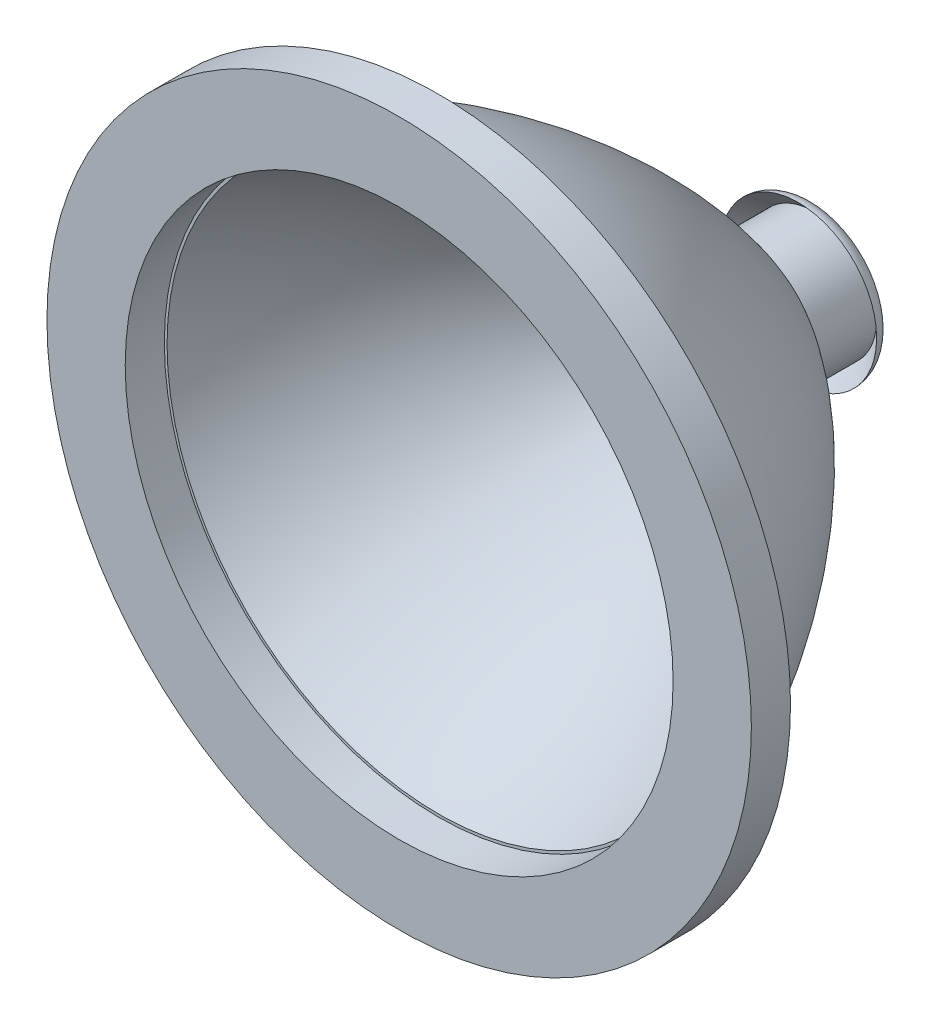
ISO-10303-21;
HEADER;
FILE_DESCRIPTION(('STEP AP214'),'2;1');
FILE_NAME('part.step','',(''),(''),'','','');
FILE_SCHEMA(('AUTOMOTIVE_DESIGN { 1 0 10303 214 1 1 1 1 }'));
ENDSEC;
DATA;
#1=APPLICATION_CONTEXT('core data for automotive mechanical design processes');
#2=APPLICATION_PROTOCOL_DEFINITION('international standard','automotive_design',2000,#1);
#3=PRODUCT_CONTEXT('',#1,'mechanical');
#4=PRODUCT('Part','Part','',(#3));
#5=PRODUCT_RELATED_PRODUCT_CATEGORY('part','',(#4));
#6=PRODUCT_DEFINITION_FORMATION('','',#4);
#7=PRODUCT_DEFINITION_CONTEXT('part definition',#1,'design');
#8=PRODUCT_DEFINITION('design','',#6,#7);
#9=PRODUCT_DEFINITION_SHAPE('','',#8);
#10=(LENGTH_UNIT() NAMED_UNIT(*) SI_UNIT(.MILLI.,.METRE.));
#11=(NAMED_UNIT(*) PLANE_ANGLE_UNIT() SI_UNIT($,.RADIAN.));
#12=(NAMED_UNIT(*) SI_UNIT($,.STERADIAN.) SOLID_ANGLE_UNIT());
#13=UNCERTAINTY_MEASURE_WITH_UNIT(LENGTH_MEASURE(1.E-05),#10,'distance_accuracy_value','');
#14=(GEOMETRIC_REPRESENTATION_CONTEXT(3) GLOBAL_UNCERTAINTY_ASSIGNED_CONTEXT((#13)) GLOBAL_UNIT_ASSIGNED_CONTEXT((#10,
#11,#12)) REPRESENTATION_CONTEXT('',''));
#15=CARTESIAN_POINT('',(0.,0.,0.));
#16=DIRECTION('',(0.,0.,1.));
#17=DIRECTION('',(1.,0.,0.));
#18=AXIS2_PLACEMENT_3D('',#15,#16,#17);
#19=CARTESIAN_POINT('',(0.,0.,-58.42));
#20=DIRECTION('',(0.,0.,1.));
#21=DIRECTION('',(1.,0.,0.));
#22=AXIS2_PLACEMENT_3D('',#19,#20,#21);
#23=TOROIDAL_SURFACE('',#22,10.16,2.54);
#24=CARTESIAN_POINT('',(0.,0.,-58.42));
#25=DIRECTION('',(0.,0.,1.));
#26=DIRECTION('',(1.,0.,0.));
#27=AXIS2_PLACEMENT_3D('',#24,#25,#26);
#28=CIRCLE('',#27,12.7);
#29=CARTESIAN_POINT('',(12.7,0.,-58.42));
#30=VERTEX_POINT('',#29);
#31=EDGE_CURVE('E11',#30,#30,#28,.T.);
#32=ORIENTED_EDGE('',*,*,#31,.F.);
#33=EDGE_LOOP('',(#32));
#34=FACE_BOUND('',#33,.T.);
#35=CARTESIAN_POINT('',(0.,0.,-60.96));
#36=DIRECTION('',(0.,0.,1.));
#37=DIRECTION('',(1.,0.,0.));
#38=AXIS2_PLACEMENT_3D('',#35,#36,#37);
#39=CIRCLE('',#38,10.16);
#40=CARTESIAN_POINT('',(10.16,0.,-60.96));
#41=VERTEX_POINT('',#40);
#42=EDGE_CURVE('E51',#41,#41,#39,.T.);
#43=ORIENTED_EDGE('',*,*,#42,.T.);
#44=EDGE_LOOP('',(#43));
#45=FACE_BOUND('',#44,.T.);
#46=ADVANCED_FACE('F45',(#34,#45),#23,.T.);
#47=CARTESIAN_POINT('',(0.,0.,-58.42));
#48=DIRECTION('',(0.,0.,1.));
#49=DIRECTION('',(1.,0.,0.));
#50=AXIS2_PLACEMENT_3D('',#47,#48,#49);
#51=CONICAL_SURFACE('',#50,12.7,0.785398163397448);
#52=ORIENTED_EDGE('',*,*,#42,.F.);
#53=EDGE_LOOP('',(#52));
#54=FACE_BOUND('',#53,.T.);
#55=ORIENTED_EDGE('',*,*,#31,.T.);
#56=EDGE_LOOP('',(#55));
#57=FACE_BOUND('',#56,.T.);
#58=ADVANCED_FACE('F58',(#54,#57),#51,.F.);
#59=CLOSED_SHELL('',(#46,#58));
#60=MANIFOLD_SOLID_BREP('B2',#59);
#61=CARTESIAN_POINT('',(0.,50.8,0.));
#62=DIRECTION('',(0.,0.,-1.));
#63=DIRECTION('',(-1.,0.,0.));
#64=AXIS2_PLACEMENT_3D('',#61,#62,#63);
#65=PLANE('',#64);
#66=CARTESIAN_POINT('',(0.,0.,0.));
#67=DIRECTION('',(0.,0.,-1.));
#68=DIRECTION('',(-1.,0.,0.));
#69=AXIS2_PLACEMENT_3D('',#66,#67,#68);
#70=CIRCLE('',#69,44.0129431509694);
#71=CARTESIAN_POINT('',(-44.0129431509694,0.,0.));
#72=VERTEX_POINT('',#71);
#73=EDGE_CURVE('E88',#72,#72,#70,.F.);
#74=ORIENTED_EDGE('',*,*,#73,.F.);
#75=EDGE_LOOP('',(#74));
#76=FACE_BOUND('',#75,.T.);
#77=CARTESIAN_POINT('',(0.,0.,0.));
#78=DIRECTION('',(0.,0.,1.));
#79=DIRECTION('',(1.,0.,0.));
#80=AXIS2_PLACEMENT_3D('',#77,#78,#79);
#81=CIRCLE('',#80,44.45);
#82=CARTESIAN_POINT('',(44.45,0.,0.));
#83=VERTEX_POINT('',#82);
#84=EDGE_CURVE('E119',#83,#83,#81,.T.);
#85=ORIENTED_EDGE('',*,*,#84,.T.);
#86=EDGE_LOOP('',(#85));
#87=FACE_BOUND('',#86,.T.);
#88=ADVANCED_FACE('F77',(#76,#87),#65,.F.);
#89=CARTESIAN_POINT('',(0.,0.,34.7283102836008));
#90=DIRECTION('',(0.,0.,1.));
#91=DIRECTION('',(1.,0.,0.));
#92=AXIS2_PLACEMENT_3D('',#89,#90,#91);
#93=DEGENERATE_TOROIDAL_SURFACE('',#92,44.680387854501,101.6,.F.);
#94=CARTESIAN_POINT('',(0.,0.,0.));
#95=DIRECTION('',(0.,0.,1.));
#96=DIRECTION('',(1.,0.,0.));
#97=AXIS2_PLACEMENT_3D('',#94,#95,#96);
#98=CIRCLE('',#97,50.8);
#99=CARTESIAN_POINT('',(50.8,0.,0.));
#100=VERTEX_POINT('',#99);
#101=EDGE_CURVE('E44',#100,#100,#98,.T.);
#102=ORIENTED_EDGE('',*,*,#101,.F.);
#103=EDGE_LOOP('',(#102));
#104=FACE_BOUND('',#103,.T.);
#105=CARTESIAN_POINT('',(0.,0.,-50.8));
#106=DIRECTION('',(0.,0.,-1.));
#107=DIRECTION('',(-1.,0.,0.));
#108=AXIS2_PLACEMENT_3D('',#105,#106,#107);
#109=CIRCLE('',#108,10.16);
#110=CARTESIAN_POINT('',(-10.16,0.,-50.8));
#111=VERTEX_POINT('',#110);
#112=EDGE_CURVE('E95',#111,#111,#109,.T.);
#113=ORIENTED_EDGE('',*,*,#112,.F.);
#114=EDGE_LOOP('',(#113));
#115=FACE_BOUND('',#114,.T.);
#116=ADVANCED_FACE('F79',(#104,#115),#93,.F.);
#117=CARTESIAN_POINT('',(0.,0.,34.7283102836008));
#118=DIRECTION('',(0.,0.,1.));
#119=DIRECTION('',(1.,0.,0.));
#120=AXIS2_PLACEMENT_3D('',#117,#118,#119);
#121=DEGENERATE_TOROIDAL_SURFACE('',#120,44.680387854501,95.25,.F.);
#122=ORIENTED_EDGE('',*,*,#73,.T.);
#123=EDGE_LOOP('',(#122));
#124=FACE_BOUND('',#123,.T.);
#125=CARTESIAN_POINT('',(0.,0.,-44.45));
#126=DIRECTION('',(0.,0.,1.));
#127=DIRECTION('',(1.,0.,0.));
#128=AXIS2_PLACEMENT_3D('',#125,#126,#127);
#129=CIRCLE('',#128,8.26635596071236);
#130=CARTESIAN_POINT('',(8.26635596071236,0.,-44.45));
#131=VERTEX_POINT('',#130);
#132=EDGE_CURVE('E84',#131,#131,#129,.T.);
#133=ORIENTED_EDGE('',*,*,#132,.F.);
#134=EDGE_LOOP('',(#133));
#135=FACE_BOUND('',#134,.T.);
#136=ADVANCED_FACE('F150',(#124,#135),#121,.T.);
#137=CARTESIAN_POINT('',(0.,0.,-44.45));
#138=DIRECTION('',(0.,0.,1.));
#139=DIRECTION('',(1.,0.,0.));
#140=AXIS2_PLACEMENT_3D('',#137,#138,#139);
#141=PLANE('',#140);
#142=CARTESIAN_POINT('',(0.,0.,-44.45));
#143=DIRECTION('',(0.,0.,1.));
#144=DIRECTION('',(1.,0.,0.));
#145=AXIS2_PLACEMENT_3D('',#142,#143,#144);
#146=CIRCLE('',#145,7.62);
#147=CARTESIAN_POINT('',(7.62,0.,-44.45));
#148=VERTEX_POINT('',#147);
#149=EDGE_CURVE('E109',#148,#148,#146,.T.);
#150=ORIENTED_EDGE('',*,*,#149,.F.);
#151=EDGE_LOOP('',(#150));
#152=FACE_BOUND('',#151,.T.);
#153=ORIENTED_EDGE('',*,*,#132,.T.);
#154=EDGE_LOOP('',(#153));
#155=FACE_BOUND('',#154,.T.);
#156=ADVANCED_FACE('F155',(#152,#155),#141,.T.);
#157=CARTESIAN_POINT('',(0.,0.,-60.96));
#158=DIRECTION('',(0.,0.,1.));
#159=DIRECTION('',(1.,0.,0.));
#160=AXIS2_PLACEMENT_3D('',#157,#158,#159);
#161=CYLINDRICAL_SURFACE('',#160,10.16);
#162=CARTESIAN_POINT('',(0.,0.,-60.96));
#163=DIRECTION('',(0.,0.,-1.));
#164=DIRECTION('',(-1.,0.,0.));
#165=AXIS2_PLACEMENT_3D('',#162,#163,#164);
#166=CIRCLE('',#165,10.16);
#167=CARTESIAN_POINT('',(-10.16,0.,-60.96));
#168=VERTEX_POINT('',#167);
#169=EDGE_CURVE('E93',#168,#168,#166,.T.);
#170=ORIENTED_EDGE('',*,*,#169,.F.);
#171=EDGE_LOOP('',(#170));
#172=FACE_BOUND('',#171,.T.);
#173=ORIENTED_EDGE('',*,*,#112,.T.);
#174=EDGE_LOOP('',(#173));
#175=FACE_BOUND('',#174,.T.);
#176=ADVANCED_FACE('F158',(#172,#175),#161,.T.);
#177=CARTESIAN_POINT('',(0.,0.,-60.96));
#178=DIRECTION('',(0.,0.,-1.));
#179=DIRECTION('',(-1.,0.,0.));
#180=AXIS2_PLACEMENT_3D('',#177,#178,#179);
#181=PLANE('',#180);
#182=CARTESIAN_POINT('',(0.,0.,-60.96));
#183=DIRECTION('',(0.,0.,1.));
#184=DIRECTION('',(1.,0.,0.));
#185=AXIS2_PLACEMENT_3D('',#182,#183,#184);
#186=CIRCLE('',#185,6.94563);
#187=CARTESIAN_POINT('',(6.94563,0.,-60.96));
#188=VERTEX_POINT('',#187);
#189=EDGE_CURVE('E98',#188,#188,#186,.T.);
#190=ORIENTED_EDGE('',*,*,#189,.T.);
#191=EDGE_LOOP('',(#190));
#192=FACE_BOUND('',#191,.T.);
#193=ORIENTED_EDGE('',*,*,#169,.T.);
#194=EDGE_LOOP('',(#193));
#195=FACE_BOUND('',#194,.T.);
#196=ADVANCED_FACE('F165',(#192,#195),#181,.T.);
#197=CARTESIAN_POINT('',(0.,0.,-44.45));
#198=DIRECTION('',(0.,0.,1.));
#199=DIRECTION('',(1.,0.,0.));
#200=AXIS2_PLACEMENT_3D('',#197,#198,#199);
#201=CYLINDRICAL_SURFACE('',#200,6.94563);
#202=ORIENTED_EDGE('',*,*,#189,.F.);
#203=EDGE_LOOP('',(#202));
#204=FACE_BOUND('',#203,.T.);
#205=CARTESIAN_POINT('',(0.,0.,-49.53));
#206=DIRECTION('',(0.,0.,1.));
#207=DIRECTION('',(1.,0.,0.));
#208=AXIS2_PLACEMENT_3D('',#205,#206,#207);
#209=CIRCLE('',#208,6.94563);
#210=CARTESIAN_POINT('',(6.94563,0.,-49.53));
#211=VERTEX_POINT('',#210);
#212=EDGE_CURVE('E103',#211,#211,#209,.T.);
#213=ORIENTED_EDGE('',*,*,#212,.T.);
#214=EDGE_LOOP('',(#213));
#215=FACE_BOUND('',#214,.T.);
#216=ADVANCED_FACE('F169',(#204,#215),#201,.F.);
#217=CARTESIAN_POINT('',(6.94563,0.,-49.53));
#218=DIRECTION('',(0.,0.,-1.));
#219=DIRECTION('',(-1.,0.,0.));
#220=AXIS2_PLACEMENT_3D('',#217,#218,#219);
#221=PLANE('',#220);
#222=ORIENTED_EDGE('',*,*,#212,.F.);
#223=EDGE_LOOP('',(#222));
#224=FACE_BOUND('',#223,.T.);
#225=CARTESIAN_POINT('',(0.,0.,-49.53));
#226=DIRECTION('',(0.,0.,1.));
#227=DIRECTION('',(1.,0.,0.));
#228=AXIS2_PLACEMENT_3D('',#225,#226,#227);
#229=CIRCLE('',#228,7.62);
#230=CARTESIAN_POINT('',(7.62,0.,-49.53));
#231=VERTEX_POINT('',#230);
#232=EDGE_CURVE('E106',#231,#231,#229,.T.);
#233=ORIENTED_EDGE('',*,*,#232,.T.);
#234=EDGE_LOOP('',(#233));
#235=FACE_BOUND('',#234,.T.);
#236=ADVANCED_FACE('F173',(#224,#235),#221,.F.);
#237=CARTESIAN_POINT('',(0.,0.,-44.45));
#238=DIRECTION('',(0.,0.,1.));
#239=DIRECTION('',(1.,0.,0.));
#240=AXIS2_PLACEMENT_3D('',#237,#238,#239);
#241=CYLINDRICAL_SURFACE('',#240,7.62);
#242=ORIENTED_EDGE('',*,*,#232,.F.);
#243=EDGE_LOOP('',(#242));
#244=FACE_BOUND('',#243,.T.);
#245=ORIENTED_EDGE('',*,*,#149,.T.);
#246=EDGE_LOOP('',(#245));
#247=FACE_BOUND('',#246,.T.);
#248=ADVANCED_FACE('F140',(#244,#247),#241,.F.);
#249=CARTESIAN_POINT('',(0.,0.,0.));
#250=DIRECTION('',(0.,0.,1.));
#251=DIRECTION('',(1.,0.,0.));
#252=AXIS2_PLACEMENT_3D('',#249,#250,#251);
#253=PLANE('',#252);
#254=CARTESIAN_POINT('',(0.,0.,0.));
#255=DIRECTION('',(0.,0.,1.));
#256=DIRECTION('',(1.,0.,0.));
#257=AXIS2_PLACEMENT_3D('',#254,#255,#256);
#258=CIRCLE('',#257,57.15);
#259=CARTESIAN_POINT('',(57.15,0.,0.));
#260=VERTEX_POINT('',#259);
#261=EDGE_CURVE('E113',#260,#260,#258,.T.);
#262=ORIENTED_EDGE('',*,*,#261,.F.);
#263=EDGE_LOOP('',(#262));
#264=FACE_BOUND('',#263,.T.);
#265=ORIENTED_EDGE('',*,*,#101,.T.);
#266=EDGE_LOOP('',(#265));
#267=FACE_BOUND('',#266,.T.);
#268=ADVANCED_FACE('F131',(#264,#267),#253,.F.);
#269=CARTESIAN_POINT('',(0.,0.,6.35));
#270=DIRECTION('',(0.,0.,1.));
#271=DIRECTION('',(1.,0.,0.));
#272=AXIS2_PLACEMENT_3D('',#269,#270,#271);
#273=PLANE('',#272);
#274=CARTESIAN_POINT('',(0.,0.,6.35));
#275=DIRECTION('',(0.,0.,1.));
#276=DIRECTION('',(1.,0.,0.));
#277=AXIS2_PLACEMENT_3D('',#274,#275,#276);
#278=CIRCLE('',#277,57.15);
#279=CARTESIAN_POINT('',(57.15,0.,6.35));
#280=VERTEX_POINT('',#279);
#281=EDGE_CURVE('E112',#280,#280,#278,.T.);
#282=ORIENTED_EDGE('',*,*,#281,.T.);
#283=EDGE_LOOP('',(#282));
#284=FACE_BOUND('',#283,.T.);
#285=CARTESIAN_POINT('',(0.,0.,6.35));
#286=DIRECTION('',(0.,0.,1.));
#287=DIRECTION('',(1.,0.,0.));
#288=AXIS2_PLACEMENT_3D('',#285,#286,#287);
#289=CIRCLE('',#288,44.45);
#290=CARTESIAN_POINT('',(44.45,0.,6.35));
#291=VERTEX_POINT('',#290);
#292=EDGE_CURVE('E116',#291,#291,#289,.T.);
#293=ORIENTED_EDGE('',*,*,#292,.F.);
#294=EDGE_LOOP('',(#293));
#295=FACE_BOUND('',#294,.T.);
#296=ADVANCED_FACE('F128',(#284,#295),#273,.T.);
#297=CARTESIAN_POINT('',(0.,0.,6.35));
#298=DIRECTION('',(0.,0.,-1.));
#299=DIRECTION('',(-1.,0.,0.));
#300=AXIS2_PLACEMENT_3D('',#297,#298,#299);
#301=CYLINDRICAL_SURFACE('',#300,57.15);
#302=ORIENTED_EDGE('',*,*,#281,.F.);
#303=EDGE_LOOP('',(#302));
#304=FACE_BOUND('',#303,.T.);
#305=ORIENTED_EDGE('',*,*,#261,.T.);
#306=EDGE_LOOP('',(#305));
#307=FACE_BOUND('',#306,.T.);
#308=ADVANCED_FACE('F130',(#304,#307),#301,.T.);
#309=CARTESIAN_POINT('',(0.,0.,6.35));
#310=DIRECTION('',(0.,0.,-1.));
#311=DIRECTION('',(-1.,0.,0.));
#312=AXIS2_PLACEMENT_3D('',#309,#310,#311);
#313=CYLINDRICAL_SURFACE('',#312,44.45);
#314=ORIENTED_EDGE('',*,*,#292,.T.);
#315=EDGE_LOOP('',(#314));
#316=FACE_BOUND('',#315,.T.);
#317=ORIENTED_EDGE('',*,*,#84,.F.);
#318=EDGE_LOOP('',(#317));
#319=FACE_BOUND('',#318,.T.);
#320=ADVANCED_FACE('F125',(#316,#319),#313,.F.);
#321=CLOSED_SHELL('',(#88,#116,#136,#156,#176,#196,#216,#236,#248,#268,#296,#308,#320));
#322=MANIFOLD_SOLID_BREP('B6',#321);
#323=ADVANCED_BREP_SHAPE_REPRESENTATION('',(#18,#60,#322),#14);
#324=SHAPE_DEFINITION_REPRESENTATION(#9,#323);
ENDSEC;
END-ISO-10303-21;
